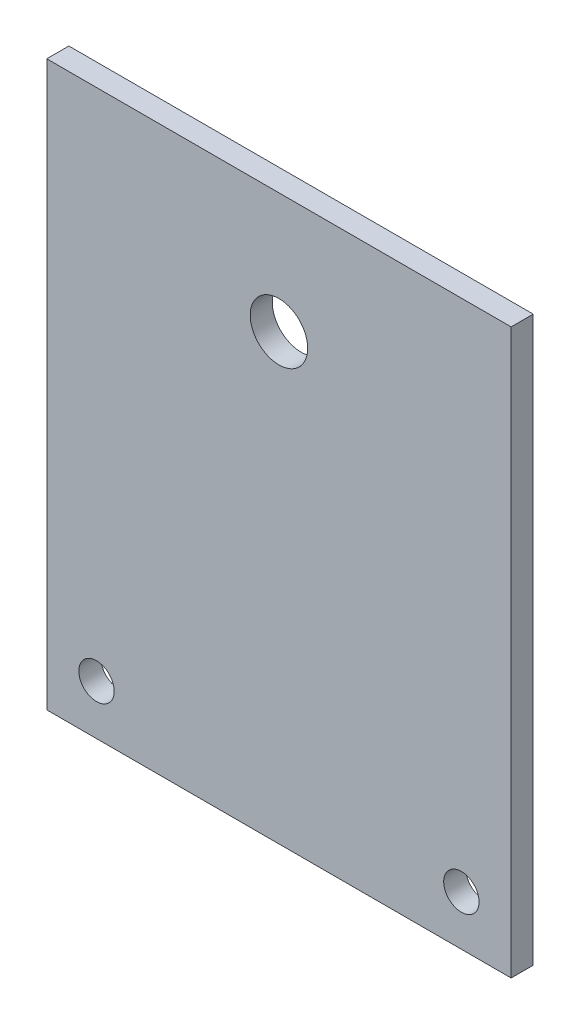
ISO-10303-21;
HEADER;
FILE_DESCRIPTION(('STEP AP214'),'2;1');
FILE_NAME('part.step','',(''),(''),'','','');
FILE_SCHEMA(('AUTOMOTIVE_DESIGN { 1 0 10303 214 1 1 1 1 }'));
ENDSEC;
DATA;
#1=APPLICATION_CONTEXT('core data for automotive mechanical design processes');
#2=APPLICATION_PROTOCOL_DEFINITION('international standard','automotive_design',2000,#1);
#3=PRODUCT_CONTEXT('',#1,'mechanical');
#4=PRODUCT('Part','Part','',(#3));
#5=PRODUCT_RELATED_PRODUCT_CATEGORY('part','',(#4));
#6=PRODUCT_DEFINITION_FORMATION('','',#4);
#7=PRODUCT_DEFINITION_CONTEXT('part definition',#1,'design');
#8=PRODUCT_DEFINITION('design','',#6,#7);
#9=PRODUCT_DEFINITION_SHAPE('','',#8);
#10=(LENGTH_UNIT() NAMED_UNIT(*) SI_UNIT(.MILLI.,.METRE.));
#11=(NAMED_UNIT(*) PLANE_ANGLE_UNIT() SI_UNIT($,.RADIAN.));
#12=(NAMED_UNIT(*) SI_UNIT($,.STERADIAN.) SOLID_ANGLE_UNIT());
#13=UNCERTAINTY_MEASURE_WITH_UNIT(LENGTH_MEASURE(1.E-05),#10,'distance_accuracy_value','');
#14=(GEOMETRIC_REPRESENTATION_CONTEXT(3) GLOBAL_UNCERTAINTY_ASSIGNED_CONTEXT((#13)) GLOBAL_UNIT_ASSIGNED_CONTEXT((#10,
#11,#12)) REPRESENTATION_CONTEXT('',''));
#15=CARTESIAN_POINT('',(0.,0.,0.));
#16=DIRECTION('',(0.,0.,1.));
#17=DIRECTION('',(1.,0.,0.));
#18=AXIS2_PLACEMENT_3D('',#15,#16,#17);
#19=CARTESIAN_POINT('',(0.,0.,2.));
#20=DIRECTION('',(0.,0.,1.));
#21=DIRECTION('',(1.,0.,0.));
#22=AXIS2_PLACEMENT_3D('',#19,#20,#21);
#23=PLANE('',#22);
#24=CARTESIAN_POINT('',(16.5,-21.,2.));
#25=DIRECTION('',(0.,0.,1.));
#26=DIRECTION('',(1.,0.,0.));
#27=AXIS2_PLACEMENT_3D('',#24,#25,#26);
#28=CIRCLE('',#27,1.6);
#29=CARTESIAN_POINT('',(18.1,-21.,2.));
#30=VERTEX_POINT('',#29);
#31=EDGE_CURVE('E121',#30,#30,#28,.T.);
#32=ORIENTED_EDGE('',*,*,#31,.F.);
#33=EDGE_LOOP('',(#32));
#34=FACE_BOUND('',#33,.T.);
#35=DIRECTION('',(0.,1.,0.));
#36=VECTOR('',#35,1.);
#37=CARTESIAN_POINT('',(21.,25.5,2.));
#38=LINE('',#37,#36);
#39=CARTESIAN_POINT('',(21.,-25.5,2.));
#40=VERTEX_POINT('',#39);
#41=CARTESIAN_POINT('',(21.,25.5,2.));
#42=VERTEX_POINT('',#41);
#43=EDGE_CURVE('E91',#40,#42,#38,.T.);
#44=ORIENTED_EDGE('',*,*,#43,.T.);
#45=DIRECTION('',(-1.,0.,0.));
#46=VECTOR('',#45,1.);
#47=CARTESIAN_POINT('',(-21.,25.5,2.));
#48=LINE('',#47,#46);
#49=CARTESIAN_POINT('',(-21.,25.5,2.));
#50=VERTEX_POINT('',#49);
#51=EDGE_CURVE('E86',#42,#50,#48,.T.);
#52=ORIENTED_EDGE('',*,*,#51,.T.);
#53=DIRECTION('',(0.,-1.,0.));
#54=VECTOR('',#53,1.);
#55=CARTESIAN_POINT('',(-21.,25.5,2.));
#56=LINE('',#55,#54);
#57=CARTESIAN_POINT('',(-21.,-25.5,2.));
#58=VERTEX_POINT('',#57);
#59=EDGE_CURVE('E89',#50,#58,#56,.T.);
#60=ORIENTED_EDGE('',*,*,#59,.T.);
#61=DIRECTION('',(1.,0.,0.));
#62=VECTOR('',#61,1.);
#63=CARTESIAN_POINT('',(-21.,-25.5,2.));
#64=LINE('',#63,#62);
#65=EDGE_CURVE('E56',#58,#40,#64,.T.);
#66=ORIENTED_EDGE('',*,*,#65,.T.);
#67=EDGE_LOOP('',(#44,#52,#60,#66));
#68=FACE_BOUND('',#67,.T.);
#69=CARTESIAN_POINT('',(-16.5,-21.,2.));
#70=DIRECTION('',(0.,0.,1.));
#71=DIRECTION('',(1.,0.,0.));
#72=AXIS2_PLACEMENT_3D('',#69,#70,#71);
#73=CIRCLE('',#72,1.6);
#74=CARTESIAN_POINT('',(-14.9,-21.,2.));
#75=VERTEX_POINT('',#74);
#76=EDGE_CURVE('E106',#75,#75,#73,.T.);
#77=ORIENTED_EDGE('',*,*,#76,.F.);
#78=EDGE_LOOP('',(#77));
#79=FACE_BOUND('',#78,.T.);
#80=CARTESIAN_POINT('',(0.,14.62,2.));
#81=DIRECTION('',(0.,0.,1.));
#82=DIRECTION('',(1.,0.,0.));
#83=AXIS2_PLACEMENT_3D('',#80,#81,#82);
#84=CIRCLE('',#83,2.6);
#85=CARTESIAN_POINT('',(2.6,14.62,2.));
#86=VERTEX_POINT('',#85);
#87=EDGE_CURVE('E127',#86,#86,#84,.T.);
#88=ORIENTED_EDGE('',*,*,#87,.F.);
#89=EDGE_LOOP('',(#88));
#90=FACE_BOUND('',#89,.T.);
#91=ADVANCED_FACE('F39',(#34,#68,#79,#90),#23,.T.);
#92=CARTESIAN_POINT('',(0.,0.,0.));
#93=DIRECTION('',(0.,0.,1.));
#94=DIRECTION('',(1.,0.,0.));
#95=AXIS2_PLACEMENT_3D('',#92,#93,#94);
#96=PLANE('',#95);
#97=DIRECTION('',(0.,1.,0.));
#98=VECTOR('',#97,1.);
#99=CARTESIAN_POINT('',(21.,25.5,0.));
#100=LINE('',#99,#98);
#101=CARTESIAN_POINT('',(21.,-25.5,0.));
#102=VERTEX_POINT('',#101);
#103=CARTESIAN_POINT('',(21.,25.5,0.));
#104=VERTEX_POINT('',#103);
#105=EDGE_CURVE('E103',#102,#104,#100,.T.);
#106=ORIENTED_EDGE('',*,*,#105,.F.);
#107=DIRECTION('',(1.,0.,0.));
#108=VECTOR('',#107,1.);
#109=CARTESIAN_POINT('',(-21.,-25.5,0.));
#110=LINE('',#109,#108);
#111=CARTESIAN_POINT('',(-21.,-25.5,0.));
#112=VERTEX_POINT('',#111);
#113=EDGE_CURVE('E79',#112,#102,#110,.T.);
#114=ORIENTED_EDGE('',*,*,#113,.F.);
#115=DIRECTION('',(0.,-1.,0.));
#116=VECTOR('',#115,1.);
#117=CARTESIAN_POINT('',(-21.,25.5,0.));
#118=LINE('',#117,#116);
#119=CARTESIAN_POINT('',(-21.,25.5,0.));
#120=VERTEX_POINT('',#119);
#121=EDGE_CURVE('E73',#120,#112,#118,.T.);
#122=ORIENTED_EDGE('',*,*,#121,.F.);
#123=DIRECTION('',(-1.,0.,0.));
#124=VECTOR('',#123,1.);
#125=CARTESIAN_POINT('',(-21.,25.5,0.));
#126=LINE('',#125,#124);
#127=EDGE_CURVE('E95',#104,#120,#126,.T.);
#128=ORIENTED_EDGE('',*,*,#127,.F.);
#129=EDGE_LOOP('',(#106,#114,#122,#128));
#130=FACE_BOUND('',#129,.T.);
#131=CARTESIAN_POINT('',(-16.5,-21.,0.));
#132=DIRECTION('',(0.,0.,1.));
#133=DIRECTION('',(1.,0.,0.));
#134=AXIS2_PLACEMENT_3D('',#131,#132,#133);
#135=CIRCLE('',#134,1.6);
#136=CARTESIAN_POINT('',(-14.9,-21.,0.));
#137=VERTEX_POINT('',#136);
#138=EDGE_CURVE('E118',#137,#137,#135,.T.);
#139=ORIENTED_EDGE('',*,*,#138,.T.);
#140=EDGE_LOOP('',(#139));
#141=FACE_BOUND('',#140,.T.);
#142=CARTESIAN_POINT('',(16.5,-21.,0.));
#143=DIRECTION('',(0.,0.,1.));
#144=DIRECTION('',(1.,0.,0.));
#145=AXIS2_PLACEMENT_3D('',#142,#143,#144);
#146=CIRCLE('',#145,1.6);
#147=CARTESIAN_POINT('',(18.1,-21.,0.));
#148=VERTEX_POINT('',#147);
#149=EDGE_CURVE('E124',#148,#148,#146,.T.);
#150=ORIENTED_EDGE('',*,*,#149,.T.);
#151=EDGE_LOOP('',(#150));
#152=FACE_BOUND('',#151,.T.);
#153=CARTESIAN_POINT('',(0.,14.62,0.));
#154=DIRECTION('',(0.,0.,1.));
#155=DIRECTION('',(1.,0.,0.));
#156=AXIS2_PLACEMENT_3D('',#153,#154,#155);
#157=CIRCLE('',#156,2.6);
#158=CARTESIAN_POINT('',(2.6,14.62,0.));
#159=VERTEX_POINT('',#158);
#160=EDGE_CURVE('E130',#159,#159,#157,.T.);
#161=ORIENTED_EDGE('',*,*,#160,.T.);
#162=EDGE_LOOP('',(#161));
#163=FACE_BOUND('',#162,.T.);
#164=ADVANCED_FACE('F114',(#130,#141,#152,#163),#96,.F.);
#165=CARTESIAN_POINT('',(21.,25.5,2.));
#166=DIRECTION('',(-1.,0.,0.));
#167=DIRECTION('',(0.,-1.,0.));
#168=AXIS2_PLACEMENT_3D('',#165,#166,#167);
#169=PLANE('',#168);
#170=ORIENTED_EDGE('',*,*,#105,.T.);
#171=DIRECTION('',(0.,0.,-1.));
#172=VECTOR('',#171,1.);
#173=CARTESIAN_POINT('',(21.,25.5,2.));
#174=LINE('',#173,#172);
#175=EDGE_CURVE('E11',#42,#104,#174,.T.);
#176=ORIENTED_EDGE('',*,*,#175,.F.);
#177=ORIENTED_EDGE('',*,*,#43,.F.);
#178=DIRECTION('',(0.,0.,-1.));
#179=VECTOR('',#178,1.);
#180=CARTESIAN_POINT('',(21.,-25.5,2.));
#181=LINE('',#180,#179);
#182=EDGE_CURVE('E99',#40,#102,#181,.T.);
#183=ORIENTED_EDGE('',*,*,#182,.T.);
#184=EDGE_LOOP('',(#170,#176,#177,#183));
#185=FACE_BOUND('',#184,.T.);
#186=ADVANCED_FACE('F41',(#185),#169,.F.);
#187=CARTESIAN_POINT('',(-21.,25.5,2.));
#188=DIRECTION('',(0.,-1.,0.));
#189=DIRECTION('',(0.,0.,-1.));
#190=AXIS2_PLACEMENT_3D('',#187,#188,#189);
#191=PLANE('',#190);
#192=ORIENTED_EDGE('',*,*,#127,.T.);
#193=DIRECTION('',(0.,0.,-1.));
#194=VECTOR('',#193,1.);
#195=CARTESIAN_POINT('',(-21.,25.5,2.));
#196=LINE('',#195,#194);
#197=EDGE_CURVE('E48',#50,#120,#196,.T.);
#198=ORIENTED_EDGE('',*,*,#197,.F.);
#199=ORIENTED_EDGE('',*,*,#51,.F.);
#200=ORIENTED_EDGE('',*,*,#175,.T.);
#201=EDGE_LOOP('',(#192,#198,#199,#200));
#202=FACE_BOUND('',#201,.T.);
#203=ADVANCED_FACE('F94',(#202),#191,.F.);
#204=CARTESIAN_POINT('',(-21.,25.5,2.));
#205=DIRECTION('',(1.,0.,0.));
#206=DIRECTION('',(0.,1.,0.));
#207=AXIS2_PLACEMENT_3D('',#204,#205,#206);
#208=PLANE('',#207);
#209=ORIENTED_EDGE('',*,*,#121,.T.);
#210=DIRECTION('',(0.,0.,-1.));
#211=VECTOR('',#210,1.);
#212=CARTESIAN_POINT('',(-21.,-25.5,2.));
#213=LINE('',#212,#211);
#214=EDGE_CURVE('E96',#58,#112,#213,.T.);
#215=ORIENTED_EDGE('',*,*,#214,.F.);
#216=ORIENTED_EDGE('',*,*,#59,.F.);
#217=ORIENTED_EDGE('',*,*,#197,.T.);
#218=EDGE_LOOP('',(#209,#215,#216,#217));
#219=FACE_BOUND('',#218,.T.);
#220=ADVANCED_FACE('F97',(#219),#208,.F.);
#221=CARTESIAN_POINT('',(-21.,-25.5,2.));
#222=DIRECTION('',(0.,1.,0.));
#223=DIRECTION('',(0.,0.,1.));
#224=AXIS2_PLACEMENT_3D('',#221,#222,#223);
#225=PLANE('',#224);
#226=ORIENTED_EDGE('',*,*,#113,.T.);
#227=ORIENTED_EDGE('',*,*,#182,.F.);
#228=ORIENTED_EDGE('',*,*,#65,.F.);
#229=ORIENTED_EDGE('',*,*,#214,.T.);
#230=EDGE_LOOP('',(#226,#227,#228,#229));
#231=FACE_BOUND('',#230,.T.);
#232=ADVANCED_FACE('F111',(#231),#225,.F.);
#233=CARTESIAN_POINT('',(-16.5,-21.,2.));
#234=DIRECTION('',(0.,0.,-1.));
#235=DIRECTION('',(-1.,0.,0.));
#236=AXIS2_PLACEMENT_3D('',#233,#234,#235);
#237=CYLINDRICAL_SURFACE('',#236,1.6);
#238=ORIENTED_EDGE('',*,*,#76,.T.);
#239=EDGE_LOOP('',(#238));
#240=FACE_BOUND('',#239,.T.);
#241=ORIENTED_EDGE('',*,*,#138,.F.);
#242=EDGE_LOOP('',(#241));
#243=FACE_BOUND('',#242,.T.);
#244=ADVANCED_FACE('F148',(#240,#243),#237,.F.);
#245=CARTESIAN_POINT('',(16.5,-21.,2.));
#246=DIRECTION('',(0.,0.,-1.));
#247=DIRECTION('',(-1.,0.,0.));
#248=AXIS2_PLACEMENT_3D('',#245,#246,#247);
#249=CYLINDRICAL_SURFACE('',#248,1.6);
#250=ORIENTED_EDGE('',*,*,#31,.T.);
#251=EDGE_LOOP('',(#250));
#252=FACE_BOUND('',#251,.T.);
#253=ORIENTED_EDGE('',*,*,#149,.F.);
#254=EDGE_LOOP('',(#253));
#255=FACE_BOUND('',#254,.T.);
#256=ADVANCED_FACE('F194',(#252,#255),#249,.F.);
#257=CARTESIAN_POINT('',(0.,14.62,2.));
#258=DIRECTION('',(0.,0.,-1.));
#259=DIRECTION('',(-1.,0.,0.));
#260=AXIS2_PLACEMENT_3D('',#257,#258,#259);
#261=CYLINDRICAL_SURFACE('',#260,2.6);
#262=ORIENTED_EDGE('',*,*,#87,.T.);
#263=EDGE_LOOP('',(#262));
#264=FACE_BOUND('',#263,.T.);
#265=ORIENTED_EDGE('',*,*,#160,.F.);
#266=EDGE_LOOP('',(#265));
#267=FACE_BOUND('',#266,.T.);
#268=ADVANCED_FACE('F136',(#264,#267),#261,.F.);
#269=CLOSED_SHELL('',(#91,#164,#186,#203,#220,#232,#244,#256,#268));
#270=MANIFOLD_SOLID_BREP('B2',#269);
#271=ADVANCED_BREP_SHAPE_REPRESENTATION('',(#18,#270),#14);
#272=SHAPE_DEFINITION_REPRESENTATION(#9,#271);
ENDSEC;
END-ISO-10303-21;
